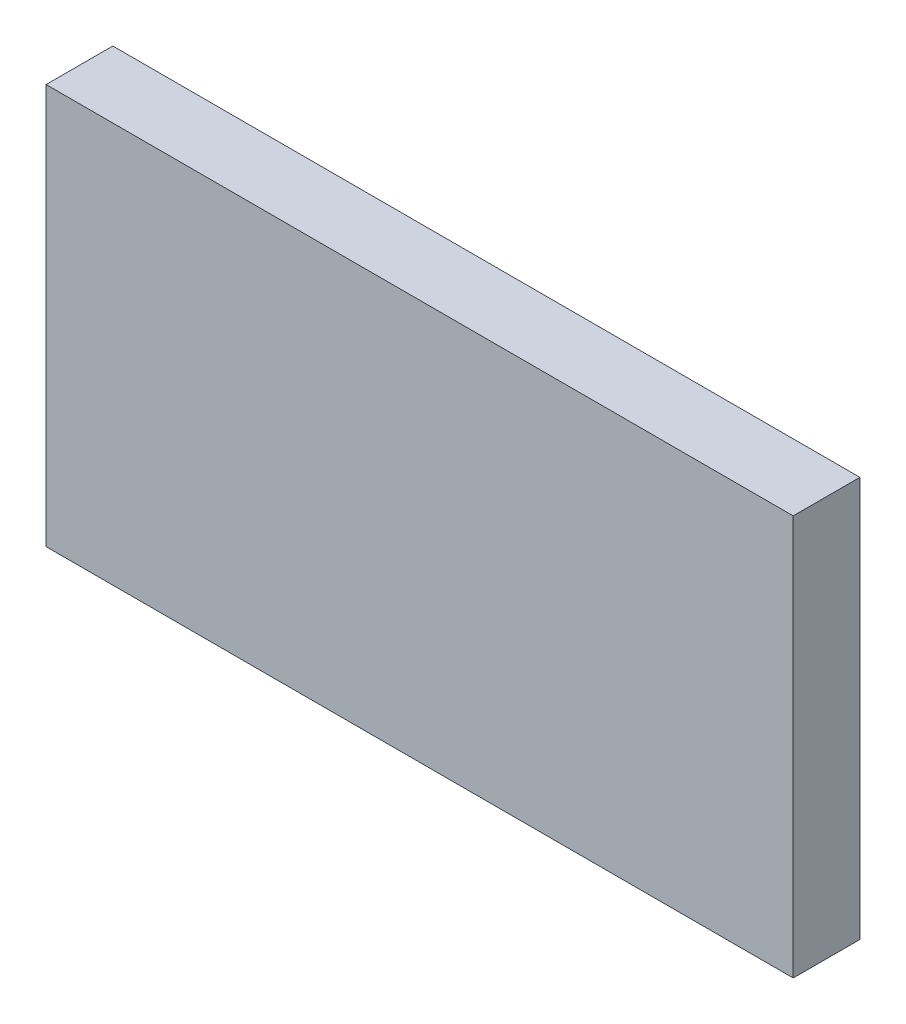
ISO-10303-21;
HEADER;
FILE_DESCRIPTION(('STEP AP214'),'2;1');
FILE_NAME('part.step','',(''),(''),'','','');
FILE_SCHEMA(('AUTOMOTIVE_DESIGN { 1 0 10303 214 1 1 1 1 }'));
ENDSEC;
DATA;
#1=APPLICATION_CONTEXT('core data for automotive mechanical design processes');
#2=APPLICATION_PROTOCOL_DEFINITION('international standard','automotive_design',2000,#1);
#3=PRODUCT_CONTEXT('',#1,'mechanical');
#4=PRODUCT('Part','Part','',(#3));
#5=PRODUCT_RELATED_PRODUCT_CATEGORY('part','',(#4));
#6=PRODUCT_DEFINITION_FORMATION('','',#4);
#7=PRODUCT_DEFINITION_CONTEXT('part definition',#1,'design');
#8=PRODUCT_DEFINITION('design','',#6,#7);
#9=PRODUCT_DEFINITION_SHAPE('','',#8);
#10=(LENGTH_UNIT() NAMED_UNIT(*) SI_UNIT(.MILLI.,.METRE.));
#11=(NAMED_UNIT(*) PLANE_ANGLE_UNIT() SI_UNIT($,.RADIAN.));
#12=(NAMED_UNIT(*) SI_UNIT($,.STERADIAN.) SOLID_ANGLE_UNIT());
#13=UNCERTAINTY_MEASURE_WITH_UNIT(LENGTH_MEASURE(1.E-05),#10,'distance_accuracy_value','');
#14=(GEOMETRIC_REPRESENTATION_CONTEXT(3) GLOBAL_UNCERTAINTY_ASSIGNED_CONTEXT((#13)) GLOBAL_UNIT_ASSIGNED_CONTEXT((#10,
#11,#12)) REPRESENTATION_CONTEXT('',''));
#15=CARTESIAN_POINT('',(0.,0.,0.));
#16=DIRECTION('',(0.,0.,1.));
#17=DIRECTION('',(1.,0.,0.));
#18=AXIS2_PLACEMENT_3D('',#15,#16,#17);
#19=CARTESIAN_POINT('',(0.182515457347921,-0.637922808555993,0.0826433070866142));
#20=DIRECTION('',(0.,0.,1.));
#21=DIRECTION('',(0.,-1.,0.));
#22=AXIS2_PLACEMENT_3D('',#19,#20,#21);
#23=PLANE('',#22);
#24=DIRECTION('',(0.,1.,0.));
#25=VECTOR('',#24,1.);
#26=CARTESIAN_POINT('',(0.108436717190441,-0.637922808555993,0.0826433070866142));
#27=LINE('',#26,#25);
#28=CARTESIAN_POINT('',(0.108436717190441,-0.636033044776465,0.0826433070866142));
#29=VERTEX_POINT('',#28);
#30=CARTESIAN_POINT('',(0.108436717190441,-0.598237769185914,0.0826433070866142));
#31=VERTEX_POINT('',#30);
#32=EDGE_CURVE('E71',#29,#31,#27,.T.);
#33=ORIENTED_EDGE('',*,*,#32,.T.);
#34=DIRECTION('',(1.,0.,0.));
#35=VECTOR('',#34,1.);
#36=CARTESIAN_POINT('',(0.182515457347921,-0.598237769185914,0.0826433070866142));
#37=LINE('',#36,#35);
#38=CARTESIAN_POINT('',(0.178987898292803,-0.598237769185914,0.0826433070866142));
#39=VERTEX_POINT('',#38);
#40=EDGE_CURVE('E54',#39,#31,#37,.F.);
#41=ORIENTED_EDGE('',*,*,#40,.F.);
#42=DIRECTION('',(0.,1.,0.));
#43=VECTOR('',#42,1.);
#44=CARTESIAN_POINT('',(0.178987898292803,-0.637922808555993,0.0826433070866142));
#45=LINE('',#44,#43);
#46=CARTESIAN_POINT('',(0.178987898292803,-0.636033044776465,0.0826433070866142));
#47=VERTEX_POINT('',#46);
#48=EDGE_CURVE('E20',#47,#39,#45,.T.);
#49=ORIENTED_EDGE('',*,*,#48,.F.);
#50=DIRECTION('',(1.,0.,0.));
#51=VECTOR('',#50,1.);
#52=CARTESIAN_POINT('',(0.104909158135323,-0.636033044776465,0.0826433070866142));
#53=LINE('',#52,#51);
#54=EDGE_CURVE('E81',#29,#47,#53,.T.);
#55=ORIENTED_EDGE('',*,*,#54,.F.);
#56=EDGE_LOOP('',(#33,#41,#49,#55));
#57=FACE_BOUND('',#56,.T.);
#58=ADVANCED_FACE('F17',(#57),#23,.F.);
#59=CARTESIAN_POINT('',(0.178987898292803,-0.637922808555993,0.0823283464566929));
#60=DIRECTION('',(-1.,0.,0.));
#61=DIRECTION('',(0.,0.,1.));
#62=AXIS2_PLACEMENT_3D('',#59,#60,#61);
#63=PLANE('',#62);
#64=DIRECTION('',(0.,0.,1.));
#65=VECTOR('',#64,1.);
#66=CARTESIAN_POINT('',(0.178987898292803,-0.636033044776465,0.0823283464566929));
#67=LINE('',#66,#65);
#68=CARTESIAN_POINT('',(0.178987898292803,-0.636033044776465,0.0889425196850394));
#69=VERTEX_POINT('',#68);
#70=EDGE_CURVE('E64',#47,#69,#67,.T.);
#71=ORIENTED_EDGE('',*,*,#70,.F.);
#72=ORIENTED_EDGE('',*,*,#48,.T.);
#73=DIRECTION('',(0.,0.,-1.));
#74=VECTOR('',#73,1.);
#75=CARTESIAN_POINT('',(0.178987898292803,-0.598237769185914,0.0823283464566929));
#76=LINE('',#75,#74);
#77=CARTESIAN_POINT('',(0.178987898292803,-0.598237769185914,0.0889425196850394));
#78=VERTEX_POINT('',#77);
#79=EDGE_CURVE('E62',#78,#39,#76,.T.);
#80=ORIENTED_EDGE('',*,*,#79,.F.);
#81=DIRECTION('',(0.,1.,0.));
#82=VECTOR('',#81,1.);
#83=CARTESIAN_POINT('',(0.178987898292803,-0.637922808555993,0.0889425196850394));
#84=LINE('',#83,#82);
#85=EDGE_CURVE('E83',#69,#78,#84,.T.);
#86=ORIENTED_EDGE('',*,*,#85,.F.);
#87=EDGE_LOOP('',(#71,#72,#80,#86));
#88=FACE_BOUND('',#87,.T.);
#89=ADVANCED_FACE('F60',(#88),#63,.F.);
#90=CARTESIAN_POINT('',(0.182515457347921,-0.598237769185914,0.0823283464566929));
#91=DIRECTION('',(0.,-1.,0.));
#92=DIRECTION('',(0.,0.,-1.));
#93=AXIS2_PLACEMENT_3D('',#90,#91,#92);
#94=PLANE('',#93);
#95=DIRECTION('',(0.,0.,1.));
#96=VECTOR('',#95,1.);
#97=CARTESIAN_POINT('',(0.108436717190441,-0.598237769185914,0.0823283464566929));
#98=LINE('',#97,#96);
#99=CARTESIAN_POINT('',(0.108436717190441,-0.598237769185914,0.0889425196850394));
#100=VERTEX_POINT('',#99);
#101=EDGE_CURVE('E73',#31,#100,#98,.T.);
#102=ORIENTED_EDGE('',*,*,#101,.T.);
#103=DIRECTION('',(1.,0.,0.));
#104=VECTOR('',#103,1.);
#105=CARTESIAN_POINT('',(0.182515457347921,-0.598237769185914,0.0889425196850394));
#106=LINE('',#105,#104);
#107=EDGE_CURVE('E69',#78,#100,#106,.F.);
#108=ORIENTED_EDGE('',*,*,#107,.F.);
#109=ORIENTED_EDGE('',*,*,#79,.T.);
#110=ORIENTED_EDGE('',*,*,#40,.T.);
#111=EDGE_LOOP('',(#102,#108,#109,#110));
#112=FACE_BOUND('',#111,.T.);
#113=ADVANCED_FACE('F68',(#112),#94,.F.);
#114=CARTESIAN_POINT('',(0.108436717190441,-0.637922808555993,0.0823283464566929));
#115=DIRECTION('',(-1.,0.,0.));
#116=DIRECTION('',(0.,0.,1.));
#117=AXIS2_PLACEMENT_3D('',#114,#115,#116);
#118=PLANE('',#117);
#119=ORIENTED_EDGE('',*,*,#32,.F.);
#120=DIRECTION('',(0.,0.,1.));
#121=VECTOR('',#120,1.);
#122=CARTESIAN_POINT('',(0.108436717190441,-0.636033044776465,0.0823283464566929));
#123=LINE('',#122,#121);
#124=CARTESIAN_POINT('',(0.108436717190441,-0.636033044776465,0.0889425196850394));
#125=VERTEX_POINT('',#124);
#126=EDGE_CURVE('E78',#125,#29,#123,.F.);
#127=ORIENTED_EDGE('',*,*,#126,.F.);
#128=DIRECTION('',(0.,1.,0.));
#129=VECTOR('',#128,1.);
#130=CARTESIAN_POINT('',(0.108436717190441,-0.637922808555993,0.0889425196850394));
#131=LINE('',#130,#129);
#132=EDGE_CURVE('E26',#100,#125,#131,.F.);
#133=ORIENTED_EDGE('',*,*,#132,.F.);
#134=ORIENTED_EDGE('',*,*,#101,.F.);
#135=EDGE_LOOP('',(#119,#127,#133,#134));
#136=FACE_BOUND('',#135,.T.);
#137=ADVANCED_FACE('F88',(#136),#118,.T.);
#138=CARTESIAN_POINT('',(0.104909158135323,-0.636033044776465,0.0823283464566929));
#139=DIRECTION('',(0.,1.,0.));
#140=DIRECTION('',(0.,0.,1.));
#141=AXIS2_PLACEMENT_3D('',#138,#139,#140);
#142=PLANE('',#141);
#143=ORIENTED_EDGE('',*,*,#126,.T.);
#144=ORIENTED_EDGE('',*,*,#54,.T.);
#145=ORIENTED_EDGE('',*,*,#70,.T.);
#146=DIRECTION('',(1.,0.,0.));
#147=VECTOR('',#146,1.);
#148=CARTESIAN_POINT('',(0.182515457347921,-0.636033044776465,0.0889425196850394));
#149=LINE('',#148,#147);
#150=EDGE_CURVE('E11',#125,#69,#149,.T.);
#151=ORIENTED_EDGE('',*,*,#150,.F.);
#152=EDGE_LOOP('',(#143,#144,#145,#151));
#153=FACE_BOUND('',#152,.T.);
#154=ADVANCED_FACE('F91',(#153),#142,.F.);
#155=CARTESIAN_POINT('',(0.182515457347921,-0.637922808555993,0.0889425196850394));
#156=DIRECTION('',(0.,0.,-1.));
#157=DIRECTION('',(0.,1.,0.));
#158=AXIS2_PLACEMENT_3D('',#155,#156,#157);
#159=PLANE('',#158);
#160=ORIENTED_EDGE('',*,*,#132,.T.);
#161=ORIENTED_EDGE('',*,*,#150,.T.);
#162=ORIENTED_EDGE('',*,*,#85,.T.);
#163=ORIENTED_EDGE('',*,*,#107,.T.);
#164=EDGE_LOOP('',(#160,#161,#162,#163));
#165=FACE_BOUND('',#164,.T.);
#166=ADVANCED_FACE('F86',(#165),#159,.F.);
#167=CLOSED_SHELL('',(#58,#89,#113,#137,#154,#166));
#168=MANIFOLD_SOLID_BREP('B1',#167);
#169=ADVANCED_BREP_SHAPE_REPRESENTATION('',(#18,#168),#14);
#170=SHAPE_DEFINITION_REPRESENTATION(#9,#169);
ENDSEC;
END-ISO-10303-21;
